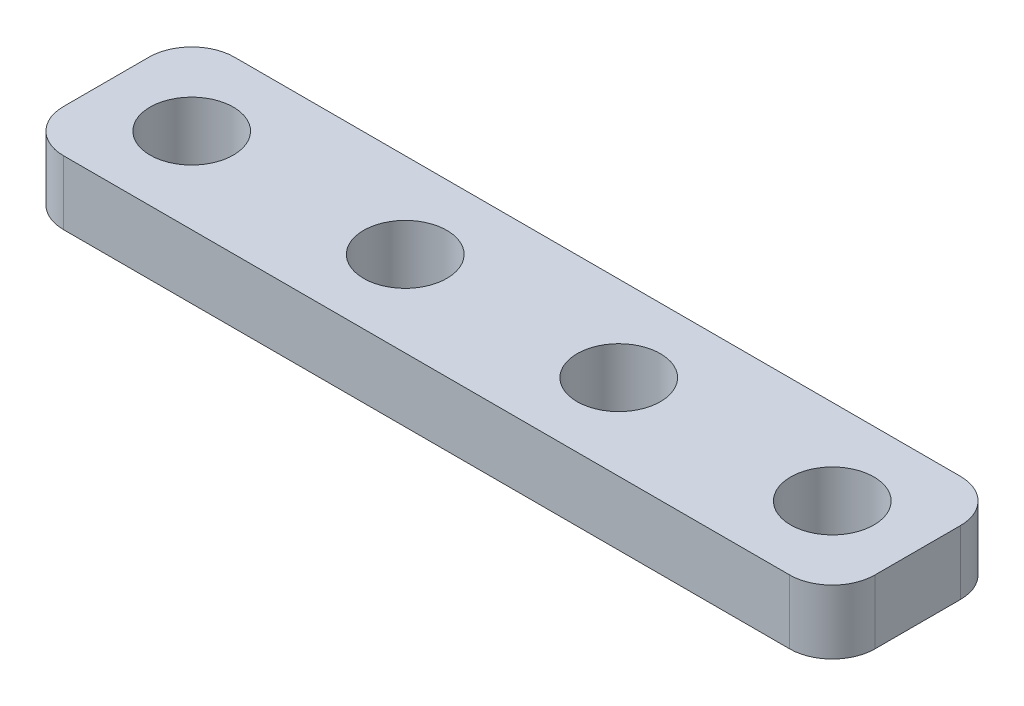
ISO-10303-21;
HEADER;
FILE_DESCRIPTION(('STEP AP214'),'2;1');
FILE_NAME('part.step','',(''),(''),'','','');
FILE_SCHEMA(('AUTOMOTIVE_DESIGN { 1 0 10303 214 1 1 1 1 }'));
ENDSEC;
DATA;
#1=APPLICATION_CONTEXT('core data for automotive mechanical design processes');
#2=APPLICATION_PROTOCOL_DEFINITION('international standard','automotive_design',2000,#1);
#3=PRODUCT_CONTEXT('',#1,'mechanical');
#4=PRODUCT('Part','Part','',(#3));
#5=PRODUCT_RELATED_PRODUCT_CATEGORY('part','',(#4));
#6=PRODUCT_DEFINITION_FORMATION('','',#4);
#7=PRODUCT_DEFINITION_CONTEXT('part definition',#1,'design');
#8=PRODUCT_DEFINITION('design','',#6,#7);
#9=PRODUCT_DEFINITION_SHAPE('','',#8);
#10=(LENGTH_UNIT() NAMED_UNIT(*) SI_UNIT(.MILLI.,.METRE.));
#11=(NAMED_UNIT(*) PLANE_ANGLE_UNIT() SI_UNIT($,.RADIAN.));
#12=(NAMED_UNIT(*) SI_UNIT($,.STERADIAN.) SOLID_ANGLE_UNIT());
#13=UNCERTAINTY_MEASURE_WITH_UNIT(LENGTH_MEASURE(1.E-05),#10,'distance_accuracy_value','');
#14=(GEOMETRIC_REPRESENTATION_CONTEXT(3) GLOBAL_UNCERTAINTY_ASSIGNED_CONTEXT((#13)) GLOBAL_UNIT_ASSIGNED_CONTEXT((#10,
#11,#12)) REPRESENTATION_CONTEXT('',''));
#15=CARTESIAN_POINT('',(0.,0.,0.));
#16=DIRECTION('',(0.,0.,1.));
#17=DIRECTION('',(1.,0.,0.));
#18=AXIS2_PLACEMENT_3D('',#15,#16,#17);
#19=CARTESIAN_POINT('',(36.,3.,6.));
#20=DIRECTION('',(0.,-1.,0.));
#21=DIRECTION('',(0.,0.,-1.));
#22=AXIS2_PLACEMENT_3D('',#19,#20,#21);
#23=CYLINDRICAL_SURFACE('',#22,2.);
#24=CARTESIAN_POINT('',(36.,0.,6.));
#25=DIRECTION('',(0.,1.,0.));
#26=DIRECTION('',(0.,0.,1.));
#27=AXIS2_PLACEMENT_3D('',#24,#25,#26);
#28=CIRCLE('',#27,2.);
#29=CARTESIAN_POINT('',(36.,0.,8.));
#30=VERTEX_POINT('',#29);
#31=CARTESIAN_POINT('',(38.,0.,6.));
#32=VERTEX_POINT('',#31);
#33=EDGE_CURVE('E129',#30,#32,#28,.T.);
#34=ORIENTED_EDGE('',*,*,#33,.T.);
#35=DIRECTION('',(0.,-1.,0.));
#36=VECTOR('',#35,1.);
#37=CARTESIAN_POINT('',(38.,3.,6.));
#38=LINE('',#37,#36);
#39=CARTESIAN_POINT('',(38.,3.,6.));
#40=VERTEX_POINT('',#39);
#41=EDGE_CURVE('E11',#40,#32,#38,.T.);
#42=ORIENTED_EDGE('',*,*,#41,.F.);
#43=CARTESIAN_POINT('',(36.,3.,6.));
#44=DIRECTION('',(0.,1.,0.));
#45=DIRECTION('',(0.,0.,1.));
#46=AXIS2_PLACEMENT_3D('',#43,#44,#45);
#47=CIRCLE('',#46,2.);
#48=CARTESIAN_POINT('',(36.,3.,8.));
#49=VERTEX_POINT('',#48);
#50=EDGE_CURVE('E144',#49,#40,#47,.T.);
#51=ORIENTED_EDGE('',*,*,#50,.F.);
#52=DIRECTION('',(0.,-1.,0.));
#53=VECTOR('',#52,1.);
#54=CARTESIAN_POINT('',(36.,3.,8.));
#55=LINE('',#54,#53);
#56=EDGE_CURVE('E125',#49,#30,#55,.T.);
#57=ORIENTED_EDGE('',*,*,#56,.T.);
#58=EDGE_LOOP('',(#34,#42,#51,#57));
#59=FACE_BOUND('',#58,.T.);
#60=ADVANCED_FACE('F33',(#59),#23,.T.);
#61=CARTESIAN_POINT('',(38.,3.,2.));
#62=DIRECTION('',(-1.,0.,0.));
#63=DIRECTION('',(0.,0.,1.));
#64=AXIS2_PLACEMENT_3D('',#61,#62,#63);
#65=PLANE('',#64);
#66=DIRECTION('',(0.,0.,-1.));
#67=VECTOR('',#66,1.);
#68=CARTESIAN_POINT('',(38.,0.,2.));
#69=LINE('',#68,#67);
#70=CARTESIAN_POINT('',(38.,0.,2.));
#71=VERTEX_POINT('',#70);
#72=EDGE_CURVE('E132',#32,#71,#69,.T.);
#73=ORIENTED_EDGE('',*,*,#72,.T.);
#74=DIRECTION('',(0.,-1.,0.));
#75=VECTOR('',#74,1.);
#76=CARTESIAN_POINT('',(38.,3.,2.));
#77=LINE('',#76,#75);
#78=CARTESIAN_POINT('',(38.,3.,2.));
#79=VERTEX_POINT('',#78);
#80=EDGE_CURVE('E41',#79,#71,#77,.T.);
#81=ORIENTED_EDGE('',*,*,#80,.F.);
#82=DIRECTION('',(0.,0.,-1.));
#83=VECTOR('',#82,1.);
#84=CARTESIAN_POINT('',(38.,3.,2.));
#85=LINE('',#84,#83);
#86=EDGE_CURVE('E92',#40,#79,#85,.T.);
#87=ORIENTED_EDGE('',*,*,#86,.F.);
#88=ORIENTED_EDGE('',*,*,#41,.T.);
#89=EDGE_LOOP('',(#73,#81,#87,#88));
#90=FACE_BOUND('',#89,.T.);
#91=ADVANCED_FACE('F235',(#90),#65,.F.);
#92=CARTESIAN_POINT('',(36.,3.,2.));
#93=DIRECTION('',(0.,-1.,0.));
#94=DIRECTION('',(0.,0.,-1.));
#95=AXIS2_PLACEMENT_3D('',#92,#93,#94);
#96=CYLINDRICAL_SURFACE('',#95,2.);
#97=CARTESIAN_POINT('',(36.,0.,2.));
#98=DIRECTION('',(0.,1.,0.));
#99=DIRECTION('',(0.,0.,-1.));
#100=AXIS2_PLACEMENT_3D('',#97,#98,#99);
#101=CIRCLE('',#100,2.);
#102=CARTESIAN_POINT('',(36.,0.,0.));
#103=VERTEX_POINT('',#102);
#104=EDGE_CURVE('E135',#71,#103,#101,.T.);
#105=ORIENTED_EDGE('',*,*,#104,.T.);
#106=DIRECTION('',(0.,-1.,0.));
#107=VECTOR('',#106,1.);
#108=CARTESIAN_POINT('',(36.,3.,0.));
#109=LINE('',#108,#107);
#110=CARTESIAN_POINT('',(36.,3.,0.));
#111=VERTEX_POINT('',#110);
#112=EDGE_CURVE('E151',#111,#103,#109,.T.);
#113=ORIENTED_EDGE('',*,*,#112,.F.);
#114=CARTESIAN_POINT('',(36.,3.,2.));
#115=DIRECTION('',(0.,1.,0.));
#116=DIRECTION('',(0.,0.,-1.));
#117=AXIS2_PLACEMENT_3D('',#114,#115,#116);
#118=CIRCLE('',#117,2.);
#119=EDGE_CURVE('E159',#79,#111,#118,.T.);
#120=ORIENTED_EDGE('',*,*,#119,.F.);
#121=ORIENTED_EDGE('',*,*,#80,.T.);
#122=EDGE_LOOP('',(#105,#113,#120,#121));
#123=FACE_BOUND('',#122,.T.);
#124=ADVANCED_FACE('F157',(#123),#96,.T.);
#125=CARTESIAN_POINT('',(2.00000000000001,3.,0.));
#126=DIRECTION('',(0.,0.,1.));
#127=DIRECTION('',(1.,0.,0.));
#128=AXIS2_PLACEMENT_3D('',#125,#126,#127);
#129=PLANE('',#128);
#130=DIRECTION('',(-1.,0.,0.));
#131=VECTOR('',#130,1.);
#132=CARTESIAN_POINT('',(2.00000000000001,0.,0.));
#133=LINE('',#132,#131);
#134=CARTESIAN_POINT('',(2.00000000000001,0.,0.));
#135=VERTEX_POINT('',#134);
#136=EDGE_CURVE('E137',#103,#135,#133,.T.);
#137=ORIENTED_EDGE('',*,*,#136,.T.);
#138=DIRECTION('',(0.,-1.,0.));
#139=VECTOR('',#138,1.);
#140=CARTESIAN_POINT('',(2.00000000000001,3.,0.));
#141=LINE('',#140,#139);
#142=CARTESIAN_POINT('',(2.00000000000001,3.,0.));
#143=VERTEX_POINT('',#142);
#144=EDGE_CURVE('E148',#143,#135,#141,.T.);
#145=ORIENTED_EDGE('',*,*,#144,.F.);
#146=DIRECTION('',(-1.,0.,0.));
#147=VECTOR('',#146,1.);
#148=CARTESIAN_POINT('',(2.00000000000001,3.,0.));
#149=LINE('',#148,#147);
#150=EDGE_CURVE('E171',#111,#143,#149,.T.);
#151=ORIENTED_EDGE('',*,*,#150,.F.);
#152=ORIENTED_EDGE('',*,*,#112,.T.);
#153=EDGE_LOOP('',(#137,#145,#151,#152));
#154=FACE_BOUND('',#153,.T.);
#155=ADVANCED_FACE('F167',(#154),#129,.F.);
#156=CARTESIAN_POINT('',(2.,3.,2.));
#157=DIRECTION('',(0.,-1.,0.));
#158=DIRECTION('',(0.,0.,-1.));
#159=AXIS2_PLACEMENT_3D('',#156,#157,#158);
#160=CYLINDRICAL_SURFACE('',#159,2.);
#161=CARTESIAN_POINT('',(2.,0.,2.));
#162=DIRECTION('',(0.,1.,0.));
#163=DIRECTION('',(0.,0.,1.));
#164=AXIS2_PLACEMENT_3D('',#161,#162,#163);
#165=CIRCLE('',#164,2.);
#166=CARTESIAN_POINT('',(0.,0.,2.00000000000001));
#167=VERTEX_POINT('',#166);
#168=EDGE_CURVE('E139',#135,#167,#165,.T.);
#169=ORIENTED_EDGE('',*,*,#168,.T.);
#170=DIRECTION('',(0.,-1.,0.));
#171=VECTOR('',#170,1.);
#172=CARTESIAN_POINT('',(0.,3.,2.00000000000001));
#173=LINE('',#172,#171);
#174=CARTESIAN_POINT('',(0.,3.,2.00000000000001));
#175=VERTEX_POINT('',#174);
#176=EDGE_CURVE('E120',#175,#167,#173,.T.);
#177=ORIENTED_EDGE('',*,*,#176,.F.);
#178=CARTESIAN_POINT('',(2.,3.,2.));
#179=DIRECTION('',(0.,1.,0.));
#180=DIRECTION('',(0.,0.,1.));
#181=AXIS2_PLACEMENT_3D('',#178,#179,#180);
#182=CIRCLE('',#181,2.);
#183=EDGE_CURVE('E111',#143,#175,#182,.T.);
#184=ORIENTED_EDGE('',*,*,#183,.F.);
#185=ORIENTED_EDGE('',*,*,#144,.T.);
#186=EDGE_LOOP('',(#169,#177,#184,#185));
#187=FACE_BOUND('',#186,.T.);
#188=ADVANCED_FACE('F170',(#187),#160,.T.);
#189=CARTESIAN_POINT('',(0.,3.,2.00000000000001));
#190=DIRECTION('',(1.,0.,0.));
#191=DIRECTION('',(0.,0.,-1.));
#192=AXIS2_PLACEMENT_3D('',#189,#190,#191);
#193=PLANE('',#192);
#194=DIRECTION('',(0.,0.,1.));
#195=VECTOR('',#194,1.);
#196=CARTESIAN_POINT('',(0.,0.,2.00000000000001));
#197=LINE('',#196,#195);
#198=CARTESIAN_POINT('',(0.,0.,6.));
#199=VERTEX_POINT('',#198);
#200=EDGE_CURVE('E119',#167,#199,#197,.T.);
#201=ORIENTED_EDGE('',*,*,#200,.T.);
#202=DIRECTION('',(0.,-1.,0.));
#203=VECTOR('',#202,1.);
#204=CARTESIAN_POINT('',(0.,3.,6.));
#205=LINE('',#204,#203);
#206=CARTESIAN_POINT('',(0.,3.,6.));
#207=VERTEX_POINT('',#206);
#208=EDGE_CURVE('E116',#207,#199,#205,.T.);
#209=ORIENTED_EDGE('',*,*,#208,.F.);
#210=DIRECTION('',(0.,0.,1.));
#211=VECTOR('',#210,1.);
#212=CARTESIAN_POINT('',(0.,3.,2.00000000000001));
#213=LINE('',#212,#211);
#214=EDGE_CURVE('E105',#175,#207,#213,.T.);
#215=ORIENTED_EDGE('',*,*,#214,.F.);
#216=ORIENTED_EDGE('',*,*,#176,.T.);
#217=EDGE_LOOP('',(#201,#209,#215,#216));
#218=FACE_BOUND('',#217,.T.);
#219=ADVANCED_FACE('F117',(#218),#193,.F.);
#220=CARTESIAN_POINT('',(2.,3.,6.));
#221=DIRECTION('',(0.,-1.,0.));
#222=DIRECTION('',(0.,0.,-1.));
#223=AXIS2_PLACEMENT_3D('',#220,#221,#222);
#224=CYLINDRICAL_SURFACE('',#223,2.);
#225=CARTESIAN_POINT('',(2.,0.,6.));
#226=DIRECTION('',(0.,1.,0.));
#227=DIRECTION('',(0.,0.,1.));
#228=AXIS2_PLACEMENT_3D('',#225,#226,#227);
#229=CIRCLE('',#228,2.);
#230=CARTESIAN_POINT('',(2.,0.,8.));
#231=VERTEX_POINT('',#230);
#232=EDGE_CURVE('E78',#199,#231,#229,.T.);
#233=ORIENTED_EDGE('',*,*,#232,.T.);
#234=DIRECTION('',(0.,-1.,0.));
#235=VECTOR('',#234,1.);
#236=CARTESIAN_POINT('',(2.,3.,8.));
#237=LINE('',#236,#235);
#238=CARTESIAN_POINT('',(2.,3.,8.));
#239=VERTEX_POINT('',#238);
#240=EDGE_CURVE('E121',#239,#231,#237,.T.);
#241=ORIENTED_EDGE('',*,*,#240,.F.);
#242=CARTESIAN_POINT('',(2.,3.,6.));
#243=DIRECTION('',(0.,1.,0.));
#244=DIRECTION('',(0.,0.,1.));
#245=AXIS2_PLACEMENT_3D('',#242,#243,#244);
#246=CIRCLE('',#245,2.);
#247=EDGE_CURVE('E109',#207,#239,#246,.T.);
#248=ORIENTED_EDGE('',*,*,#247,.F.);
#249=ORIENTED_EDGE('',*,*,#208,.T.);
#250=EDGE_LOOP('',(#233,#241,#248,#249));
#251=FACE_BOUND('',#250,.T.);
#252=ADVANCED_FACE('F123',(#251),#224,.T.);
#253=CARTESIAN_POINT('',(2.,3.,8.));
#254=DIRECTION('',(0.,0.,-1.));
#255=DIRECTION('',(-1.,0.,0.));
#256=AXIS2_PLACEMENT_3D('',#253,#254,#255);
#257=PLANE('',#256);
#258=DIRECTION('',(1.,0.,0.));
#259=VECTOR('',#258,1.);
#260=CARTESIAN_POINT('',(2.,0.,8.));
#261=LINE('',#260,#259);
#262=EDGE_CURVE('E84',#231,#30,#261,.T.);
#263=ORIENTED_EDGE('',*,*,#262,.T.);
#264=ORIENTED_EDGE('',*,*,#56,.F.);
#265=DIRECTION('',(1.,0.,0.));
#266=VECTOR('',#265,1.);
#267=CARTESIAN_POINT('',(2.,3.,8.));
#268=LINE('',#267,#266);
#269=EDGE_CURVE('E49',#239,#49,#268,.T.);
#270=ORIENTED_EDGE('',*,*,#269,.F.);
#271=ORIENTED_EDGE('',*,*,#240,.T.);
#272=EDGE_LOOP('',(#263,#264,#270,#271));
#273=FACE_BOUND('',#272,.T.);
#274=ADVANCED_FACE('F212',(#273),#257,.F.);
#275=CARTESIAN_POINT('',(36.,3.,6.));
#276=DIRECTION('',(0.,1.,0.));
#277=DIRECTION('',(0.,0.,1.));
#278=AXIS2_PLACEMENT_3D('',#275,#276,#277);
#279=PLANE('',#278);
#280=CARTESIAN_POINT('',(34.,3.,3.99999999999999));
#281=DIRECTION('',(0.,1.,0.));
#282=DIRECTION('',(0.,0.,1.));
#283=AXIS2_PLACEMENT_3D('',#280,#281,#282);
#284=CIRCLE('',#283,1.95);
#285=CARTESIAN_POINT('',(34.,3.,5.94999999999999));
#286=VERTEX_POINT('',#285);
#287=EDGE_CURVE('E190',#286,#286,#284,.T.);
#288=ORIENTED_EDGE('',*,*,#287,.F.);
#289=EDGE_LOOP('',(#288));
#290=FACE_BOUND('',#289,.T.);
#291=CARTESIAN_POINT('',(4.,3.,4.));
#292=DIRECTION('',(0.,1.,0.));
#293=DIRECTION('',(0.,0.,1.));
#294=AXIS2_PLACEMENT_3D('',#291,#292,#293);
#295=CIRCLE('',#294,1.95);
#296=CARTESIAN_POINT('',(4.,3.,5.95));
#297=VERTEX_POINT('',#296);
#298=EDGE_CURVE('E191',#297,#297,#295,.T.);
#299=ORIENTED_EDGE('',*,*,#298,.F.);
#300=EDGE_LOOP('',(#299));
#301=FACE_BOUND('',#300,.T.);
#302=CARTESIAN_POINT('',(14.,3.,4.));
#303=DIRECTION('',(0.,1.,0.));
#304=DIRECTION('',(0.,0.,1.));
#305=AXIS2_PLACEMENT_3D('',#302,#303,#304);
#306=CIRCLE('',#305,1.95);
#307=CARTESIAN_POINT('',(14.,3.,5.94999999999999));
#308=VERTEX_POINT('',#307);
#309=EDGE_CURVE('E177',#308,#308,#306,.T.);
#310=ORIENTED_EDGE('',*,*,#309,.F.);
#311=EDGE_LOOP('',(#310));
#312=FACE_BOUND('',#311,.T.);
#313=CARTESIAN_POINT('',(24.,3.,3.99999999999999));
#314=DIRECTION('',(0.,1.,0.));
#315=DIRECTION('',(0.,0.,1.));
#316=AXIS2_PLACEMENT_3D('',#313,#314,#315);
#317=CIRCLE('',#316,1.95);
#318=CARTESIAN_POINT('',(24.,3.,5.94999999999999));
#319=VERTEX_POINT('',#318);
#320=EDGE_CURVE('E184',#319,#319,#317,.T.);
#321=ORIENTED_EDGE('',*,*,#320,.F.);
#322=EDGE_LOOP('',(#321));
#323=FACE_BOUND('',#322,.T.);
#324=ORIENTED_EDGE('',*,*,#50,.T.);
#325=ORIENTED_EDGE('',*,*,#86,.T.);
#326=ORIENTED_EDGE('',*,*,#119,.T.);
#327=ORIENTED_EDGE('',*,*,#150,.T.);
#328=ORIENTED_EDGE('',*,*,#183,.T.);
#329=ORIENTED_EDGE('',*,*,#214,.T.);
#330=ORIENTED_EDGE('',*,*,#247,.T.);
#331=ORIENTED_EDGE('',*,*,#269,.T.);
#332=EDGE_LOOP('',(#324,#325,#326,#327,#328,#329,#330,#331));
#333=FACE_BOUND('',#332,.T.);
#334=ADVANCED_FACE('F107',(#290,#301,#312,#323,#333),#279,.T.);
#335=CARTESIAN_POINT('',(36.,0.,6.));
#336=DIRECTION('',(0.,1.,0.));
#337=DIRECTION('',(0.,0.,1.));
#338=AXIS2_PLACEMENT_3D('',#335,#336,#337);
#339=PLANE('',#338);
#340=CARTESIAN_POINT('',(34.,0.,3.99999999999999));
#341=DIRECTION('',(0.,1.,0.));
#342=DIRECTION('',(0.,0.,1.));
#343=AXIS2_PLACEMENT_3D('',#340,#341,#342);
#344=CIRCLE('',#343,1.95);
#345=CARTESIAN_POINT('',(34.,0.,5.94999999999999));
#346=VERTEX_POINT('',#345);
#347=EDGE_CURVE('E133',#346,#346,#344,.T.);
#348=ORIENTED_EDGE('',*,*,#347,.T.);
#349=EDGE_LOOP('',(#348));
#350=FACE_BOUND('',#349,.T.);
#351=CARTESIAN_POINT('',(4.,0.,4.));
#352=DIRECTION('',(0.,1.,0.));
#353=DIRECTION('',(0.,0.,1.));
#354=AXIS2_PLACEMENT_3D('',#351,#352,#353);
#355=CIRCLE('',#354,1.95);
#356=CARTESIAN_POINT('',(4.,0.,5.95));
#357=VERTEX_POINT('',#356);
#358=EDGE_CURVE('E181',#357,#357,#355,.T.);
#359=ORIENTED_EDGE('',*,*,#358,.T.);
#360=EDGE_LOOP('',(#359));
#361=FACE_BOUND('',#360,.T.);
#362=CARTESIAN_POINT('',(14.,0.,4.));
#363=DIRECTION('',(0.,1.,0.));
#364=DIRECTION('',(0.,0.,1.));
#365=AXIS2_PLACEMENT_3D('',#362,#363,#364);
#366=CIRCLE('',#365,1.95);
#367=CARTESIAN_POINT('',(14.,0.,5.94999999999999));
#368=VERTEX_POINT('',#367);
#369=EDGE_CURVE('E180',#368,#368,#366,.T.);
#370=ORIENTED_EDGE('',*,*,#369,.T.);
#371=EDGE_LOOP('',(#370));
#372=FACE_BOUND('',#371,.T.);
#373=CARTESIAN_POINT('',(24.,0.,3.99999999999999));
#374=DIRECTION('',(0.,1.,0.));
#375=DIRECTION('',(0.,0.,1.));
#376=AXIS2_PLACEMENT_3D('',#373,#374,#375);
#377=CIRCLE('',#376,1.95);
#378=CARTESIAN_POINT('',(24.,0.,5.94999999999999));
#379=VERTEX_POINT('',#378);
#380=EDGE_CURVE('E187',#379,#379,#377,.T.);
#381=ORIENTED_EDGE('',*,*,#380,.T.);
#382=EDGE_LOOP('',(#381));
#383=FACE_BOUND('',#382,.T.);
#384=ORIENTED_EDGE('',*,*,#33,.F.);
#385=ORIENTED_EDGE('',*,*,#262,.F.);
#386=ORIENTED_EDGE('',*,*,#232,.F.);
#387=ORIENTED_EDGE('',*,*,#200,.F.);
#388=ORIENTED_EDGE('',*,*,#168,.F.);
#389=ORIENTED_EDGE('',*,*,#136,.F.);
#390=ORIENTED_EDGE('',*,*,#104,.F.);
#391=ORIENTED_EDGE('',*,*,#72,.F.);
#392=EDGE_LOOP('',(#384,#385,#386,#387,#388,#389,#390,#391));
#393=FACE_BOUND('',#392,.T.);
#394=ADVANCED_FACE('F163',(#350,#361,#372,#383,#393),#339,.F.);
#395=CARTESIAN_POINT('',(24.,0.,3.99999999999999));
#396=DIRECTION('',(0.,1.,0.));
#397=DIRECTION('',(0.,0.,1.));
#398=AXIS2_PLACEMENT_3D('',#395,#396,#397);
#399=CYLINDRICAL_SURFACE('',#398,1.95);
#400=ORIENTED_EDGE('',*,*,#380,.F.);
#401=EDGE_LOOP('',(#400));
#402=FACE_BOUND('',#401,.T.);
#403=ORIENTED_EDGE('',*,*,#320,.T.);
#404=EDGE_LOOP('',(#403));
#405=FACE_BOUND('',#404,.T.);
#406=ADVANCED_FACE('F220',(#402,#405),#399,.F.);
#407=CARTESIAN_POINT('',(14.,0.,4.));
#408=DIRECTION('',(0.,1.,0.));
#409=DIRECTION('',(0.,0.,1.));
#410=AXIS2_PLACEMENT_3D('',#407,#408,#409);
#411=CYLINDRICAL_SURFACE('',#410,1.95);
#412=ORIENTED_EDGE('',*,*,#369,.F.);
#413=EDGE_LOOP('',(#412));
#414=FACE_BOUND('',#413,.T.);
#415=ORIENTED_EDGE('',*,*,#309,.T.);
#416=EDGE_LOOP('',(#415));
#417=FACE_BOUND('',#416,.T.);
#418=ADVANCED_FACE('F222',(#414,#417),#411,.F.);
#419=CARTESIAN_POINT('',(4.,0.,4.));
#420=DIRECTION('',(0.,1.,0.));
#421=DIRECTION('',(0.,0.,1.));
#422=AXIS2_PLACEMENT_3D('',#419,#420,#421);
#423=CYLINDRICAL_SURFACE('',#422,1.95);
#424=ORIENTED_EDGE('',*,*,#358,.F.);
#425=EDGE_LOOP('',(#424));
#426=FACE_BOUND('',#425,.T.);
#427=ORIENTED_EDGE('',*,*,#298,.T.);
#428=EDGE_LOOP('',(#427));
#429=FACE_BOUND('',#428,.T.);
#430=ADVANCED_FACE('F206',(#426,#429),#423,.F.);
#431=CARTESIAN_POINT('',(34.,0.,3.99999999999999));
#432=DIRECTION('',(0.,1.,0.));
#433=DIRECTION('',(0.,0.,1.));
#434=AXIS2_PLACEMENT_3D('',#431,#432,#433);
#435=CYLINDRICAL_SURFACE('',#434,1.95);
#436=ORIENTED_EDGE('',*,*,#347,.F.);
#437=EDGE_LOOP('',(#436));
#438=FACE_BOUND('',#437,.T.);
#439=ORIENTED_EDGE('',*,*,#287,.T.);
#440=EDGE_LOOP('',(#439));
#441=FACE_BOUND('',#440,.T.);
#442=ADVANCED_FACE('F203',(#438,#441),#435,.F.);
#443=CLOSED_SHELL('',(#60,#91,#124,#155,#188,#219,#252,#274,#334,#394,#406,#418,#430,#442));
#444=MANIFOLD_SOLID_BREP('B2',#443);
#445=ADVANCED_BREP_SHAPE_REPRESENTATION('',(#18,#444),#14);
#446=SHAPE_DEFINITION_REPRESENTATION(#9,#445);
ENDSEC;
END-ISO-10303-21;
